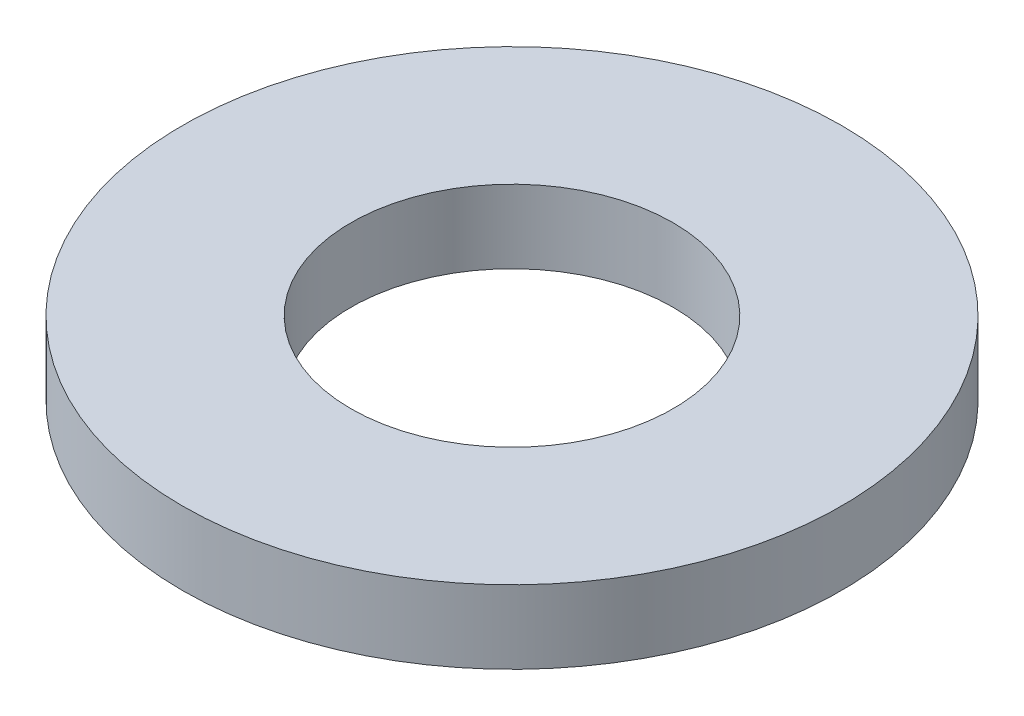
ISO-10303-21;
HEADER;
FILE_DESCRIPTION(('STEP AP214'),'2;1');
FILE_NAME('part.step','',(''),(''),'','','');
FILE_SCHEMA(('AUTOMOTIVE_DESIGN { 1 0 10303 214 1 1 1 1 }'));
ENDSEC;
DATA;
#1=APPLICATION_CONTEXT('core data for automotive mechanical design processes');
#2=APPLICATION_PROTOCOL_DEFINITION('international standard','automotive_design',2000,#1);
#3=PRODUCT_CONTEXT('',#1,'mechanical');
#4=PRODUCT('Part','Part','',(#3));
#5=PRODUCT_RELATED_PRODUCT_CATEGORY('part','',(#4));
#6=PRODUCT_DEFINITION_FORMATION('','',#4);
#7=PRODUCT_DEFINITION_CONTEXT('part definition',#1,'design');
#8=PRODUCT_DEFINITION('design','',#6,#7);
#9=PRODUCT_DEFINITION_SHAPE('','',#8);
#10=(LENGTH_UNIT() NAMED_UNIT(*) SI_UNIT(.MILLI.,.METRE.));
#11=(NAMED_UNIT(*) PLANE_ANGLE_UNIT() SI_UNIT($,.RADIAN.));
#12=(NAMED_UNIT(*) SI_UNIT($,.STERADIAN.) SOLID_ANGLE_UNIT());
#13=UNCERTAINTY_MEASURE_WITH_UNIT(LENGTH_MEASURE(1.E-05),#10,'distance_accuracy_value','');
#14=(GEOMETRIC_REPRESENTATION_CONTEXT(3) GLOBAL_UNCERTAINTY_ASSIGNED_CONTEXT((#13)) GLOBAL_UNIT_ASSIGNED_CONTEXT((#10,
#11,#12)) REPRESENTATION_CONTEXT('',''));
#15=CARTESIAN_POINT('',(0.,0.,0.));
#16=DIRECTION('',(0.,0.,1.));
#17=DIRECTION('',(1.,0.,0.));
#18=AXIS2_PLACEMENT_3D('',#15,#16,#17);
#19=CARTESIAN_POINT('',(0.,0.5,0.));
#20=DIRECTION('',(0.,1.,0.));
#21=DIRECTION('',(0.,0.,1.));
#22=AXIS2_PLACEMENT_3D('',#19,#20,#21);
#23=PLANE('',#22);
#24=CARTESIAN_POINT('',(0.,0.5,0.));
#25=DIRECTION('',(0.,1.,0.));
#26=DIRECTION('',(0.,0.,1.));
#27=AXIS2_PLACEMENT_3D('',#24,#25,#26);
#28=CIRCLE('',#27,2.25);
#29=CARTESIAN_POINT('',(0.,0.5,2.25));
#30=VERTEX_POINT('',#29);
#31=EDGE_CURVE('E10',#30,#30,#28,.T.);
#32=ORIENTED_EDGE('',*,*,#31,.T.);
#33=EDGE_LOOP('',(#32));
#34=FACE_BOUND('',#33,.T.);
#35=CARTESIAN_POINT('',(0.,0.5,0.));
#36=DIRECTION('',(0.,1.,0.));
#37=DIRECTION('',(0.,0.,1.));
#38=AXIS2_PLACEMENT_3D('',#35,#36,#37);
#39=CIRCLE('',#38,1.1);
#40=CARTESIAN_POINT('',(0.,0.5,1.1));
#41=VERTEX_POINT('',#40);
#42=EDGE_CURVE('E45',#41,#41,#39,.T.);
#43=ORIENTED_EDGE('',*,*,#42,.F.);
#44=EDGE_LOOP('',(#43));
#45=FACE_BOUND('',#44,.T.);
#46=ADVANCED_FACE('F34',(#34,#45),#23,.T.);
#47=CARTESIAN_POINT('',(0.,0.,0.));
#48=DIRECTION('',(0.,1.,0.));
#49=DIRECTION('',(0.,0.,1.));
#50=AXIS2_PLACEMENT_3D('',#47,#48,#49);
#51=PLANE('',#50);
#52=CARTESIAN_POINT('',(0.,0.,0.));
#53=DIRECTION('',(0.,1.,0.));
#54=DIRECTION('',(0.,0.,1.));
#55=AXIS2_PLACEMENT_3D('',#52,#53,#54);
#56=CIRCLE('',#55,2.25);
#57=CARTESIAN_POINT('',(0.,0.,2.25));
#58=VERTEX_POINT('',#57);
#59=EDGE_CURVE('E38',#58,#58,#56,.T.);
#60=ORIENTED_EDGE('',*,*,#59,.F.);
#61=EDGE_LOOP('',(#60));
#62=FACE_BOUND('',#61,.T.);
#63=CARTESIAN_POINT('',(0.,0.,0.));
#64=DIRECTION('',(0.,1.,0.));
#65=DIRECTION('',(0.,0.,1.));
#66=AXIS2_PLACEMENT_3D('',#63,#64,#65);
#67=CIRCLE('',#66,1.1);
#68=CARTESIAN_POINT('',(0.,0.,1.1));
#69=VERTEX_POINT('',#68);
#70=EDGE_CURVE('E47',#69,#69,#67,.T.);
#71=ORIENTED_EDGE('',*,*,#70,.T.);
#72=EDGE_LOOP('',(#71));
#73=FACE_BOUND('',#72,.T.);
#74=ADVANCED_FACE('F57',(#62,#73),#51,.F.);
#75=CARTESIAN_POINT('',(0.,0.5,0.));
#76=DIRECTION('',(0.,-1.,0.));
#77=DIRECTION('',(0.,0.,-1.));
#78=AXIS2_PLACEMENT_3D('',#75,#76,#77);
#79=CYLINDRICAL_SURFACE('',#78,2.25);
#80=ORIENTED_EDGE('',*,*,#31,.F.);
#81=EDGE_LOOP('',(#80));
#82=FACE_BOUND('',#81,.T.);
#83=ORIENTED_EDGE('',*,*,#59,.T.);
#84=EDGE_LOOP('',(#83));
#85=FACE_BOUND('',#84,.T.);
#86=ADVANCED_FACE('F36',(#82,#85),#79,.T.);
#87=CARTESIAN_POINT('',(0.,0.5,0.));
#88=DIRECTION('',(0.,-1.,0.));
#89=DIRECTION('',(0.,0.,-1.));
#90=AXIS2_PLACEMENT_3D('',#87,#88,#89);
#91=CYLINDRICAL_SURFACE('',#90,1.1);
#92=ORIENTED_EDGE('',*,*,#42,.T.);
#93=EDGE_LOOP('',(#92));
#94=FACE_BOUND('',#93,.T.);
#95=ORIENTED_EDGE('',*,*,#70,.F.);
#96=EDGE_LOOP('',(#95));
#97=FACE_BOUND('',#96,.T.);
#98=ADVANCED_FACE('F53',(#94,#97),#91,.F.);
#99=CLOSED_SHELL('',(#46,#74,#86,#98));
#100=MANIFOLD_SOLID_BREP('B2',#99);
#101=ADVANCED_BREP_SHAPE_REPRESENTATION('',(#18,#100),#14);
#102=SHAPE_DEFINITION_REPRESENTATION(#9,#101);
ENDSEC;
END-ISO-10303-21;
